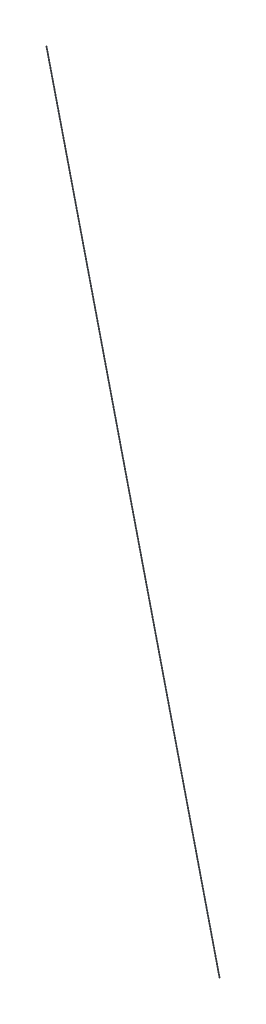
ISO-10303-21;
HEADER;
FILE_DESCRIPTION(('STEP AP214'),'2;1');
FILE_NAME('part.step','',(''),(''),'','','');
FILE_SCHEMA(('AUTOMOTIVE_DESIGN { 1 0 10303 214 1 1 1 1 }'));
ENDSEC;
DATA;
#1=APPLICATION_CONTEXT('core data for automotive mechanical design processes');
#2=APPLICATION_PROTOCOL_DEFINITION('international standard','automotive_design',2000,#1);
#3=PRODUCT_CONTEXT('',#1,'mechanical');
#4=PRODUCT('Part','Part','',(#3));
#5=PRODUCT_RELATED_PRODUCT_CATEGORY('part','',(#4));
#6=PRODUCT_DEFINITION_FORMATION('','',#4);
#7=PRODUCT_DEFINITION_CONTEXT('part definition',#1,'design');
#8=PRODUCT_DEFINITION('design','',#6,#7);
#9=PRODUCT_DEFINITION_SHAPE('','',#8);
#10=(LENGTH_UNIT() NAMED_UNIT(*) SI_UNIT(.MILLI.,.METRE.));
#11=(NAMED_UNIT(*) PLANE_ANGLE_UNIT() SI_UNIT($,.RADIAN.));
#12=(NAMED_UNIT(*) SI_UNIT($,.STERADIAN.) SOLID_ANGLE_UNIT());
#13=UNCERTAINTY_MEASURE_WITH_UNIT(LENGTH_MEASURE(1.E-05),#10,'distance_accuracy_value','');
#14=(GEOMETRIC_REPRESENTATION_CONTEXT(3) GLOBAL_UNCERTAINTY_ASSIGNED_CONTEXT((#13)) GLOBAL_UNIT_ASSIGNED_CONTEXT((#10,
#11,#12)) REPRESENTATION_CONTEXT('',''));
#15=CARTESIAN_POINT('',(0.,0.,0.));
#16=DIRECTION('',(0.,0.,1.));
#17=DIRECTION('',(1.,0.,0.));
#18=AXIS2_PLACEMENT_3D('',#15,#16,#17);
#19=CARTESIAN_POINT('',(307.5,0.,0.));
#20=DIRECTION('',(-0.233695444699784,0.972309847284584,0.));
#21=DIRECTION('',(-0.972309847284584,-0.233695444699784,0.));
#22=AXIS2_PLACEMENT_3D('',#19,#20,#21);
#23=PLANE('',#22);
#24=CARTESIAN_POINT('',(307.5,0.,0.));
#25=DIRECTION('',(-0.233695444699784,0.972309847284584,0.));
#26=DIRECTION('',(-0.972309847284584,-0.233695444699784,0.));
#27=AXIS2_PLACEMENT_3D('',#24,#25,#26);
#28=CIRCLE('',#27,0.499999999999999);
#29=CARTESIAN_POINT('',(307.013845076358,-0.116847722349892,0.));
#30=VERTEX_POINT('',#29);
#31=EDGE_CURVE('E50',#30,#30,#28,.T.);
#32=ORIENTED_EDGE('',*,*,#31,.F.);
#33=EDGE_LOOP('',(#32));
#34=FACE_BOUND('',#33,.T.);
#35=ADVANCED_FACE('F43',(#34),#23,.F.);
#36=CARTESIAN_POINT('',(0.,1279.38,0.));
#37=DIRECTION('',(-0.233695444699784,0.972309847284584,0.));
#38=DIRECTION('',(-0.972309847284584,-0.233695444699784,0.));
#39=AXIS2_PLACEMENT_3D('',#36,#37,#38);
#40=PLANE('',#39);
#41=CARTESIAN_POINT('',(0.,1279.38,0.));
#42=DIRECTION('',(-0.233695444699784,0.972309847284584,0.));
#43=DIRECTION('',(-0.972309847284584,-0.233695444699784,0.));
#44=AXIS2_PLACEMENT_3D('',#41,#42,#43);
#45=CIRCLE('',#44,0.499999999999999);
#46=CARTESIAN_POINT('',(-0.48615492364229,1279.26315227765,0.));
#47=VERTEX_POINT('',#46);
#48=EDGE_CURVE('E11',#47,#47,#45,.T.);
#49=ORIENTED_EDGE('',*,*,#48,.T.);
#50=EDGE_LOOP('',(#49));
#51=FACE_BOUND('',#50,.T.);
#52=ADVANCED_FACE('F60',(#51),#40,.T.);
#53=CARTESIAN_POINT('',(307.5,0.,0.));
#54=DIRECTION('',(-0.233695444699784,0.972309847284584,0.));
#55=DIRECTION('',(-0.972309847284584,-0.233695444699784,0.));
#56=AXIS2_PLACEMENT_3D('',#53,#54,#55);
#57=CYLINDRICAL_SURFACE('',#56,0.499999999999999);
#58=ORIENTED_EDGE('',*,*,#48,.F.);
#59=EDGE_LOOP('',(#58));
#60=FACE_BOUND('',#59,.T.);
#61=ORIENTED_EDGE('',*,*,#31,.T.);
#62=EDGE_LOOP('',(#61));
#63=FACE_BOUND('',#62,.T.);
#64=ADVANCED_FACE('F57',(#60,#63),#57,.T.);
#65=CLOSED_SHELL('',(#35,#52,#64));
#66=MANIFOLD_SOLID_BREP('B2',#65);
#67=ADVANCED_BREP_SHAPE_REPRESENTATION('',(#18,#66),#14);
#68=SHAPE_DEFINITION_REPRESENTATION(#9,#67);
ENDSEC;
END-ISO-10303-21;
